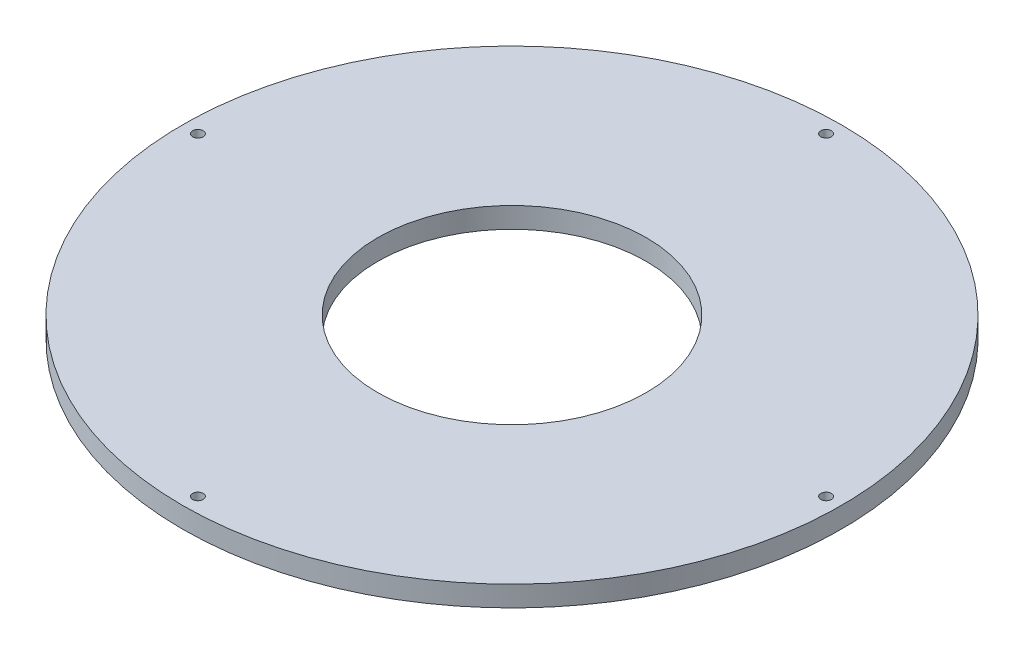
ISO-10303-21;
HEADER;
FILE_DESCRIPTION(('STEP AP214'),'2;1');
FILE_NAME('part.step','',(''),(''),'','','');
FILE_SCHEMA(('AUTOMOTIVE_DESIGN { 1 0 10303 214 1 1 1 1 }'));
ENDSEC;
DATA;
#1=APPLICATION_CONTEXT('core data for automotive mechanical design processes');
#2=APPLICATION_PROTOCOL_DEFINITION('international standard','automotive_design',2000,#1);
#3=PRODUCT_CONTEXT('',#1,'mechanical');
#4=PRODUCT('Part','Part','',(#3));
#5=PRODUCT_RELATED_PRODUCT_CATEGORY('part','',(#4));
#6=PRODUCT_DEFINITION_FORMATION('','',#4);
#7=PRODUCT_DEFINITION_CONTEXT('part definition',#1,'design');
#8=PRODUCT_DEFINITION('design','',#6,#7);
#9=PRODUCT_DEFINITION_SHAPE('','',#8);
#10=(LENGTH_UNIT() NAMED_UNIT(*) SI_UNIT(.MILLI.,.METRE.));
#11=(NAMED_UNIT(*) PLANE_ANGLE_UNIT() SI_UNIT($,.RADIAN.));
#12=(NAMED_UNIT(*) SI_UNIT($,.STERADIAN.) SOLID_ANGLE_UNIT());
#13=UNCERTAINTY_MEASURE_WITH_UNIT(LENGTH_MEASURE(1.E-05),#10,'distance_accuracy_value','');
#14=(GEOMETRIC_REPRESENTATION_CONTEXT(3) GLOBAL_UNCERTAINTY_ASSIGNED_CONTEXT((#13)) GLOBAL_UNIT_ASSIGNED_CONTEXT((#10,
#11,#12)) REPRESENTATION_CONTEXT('',''));
#15=CARTESIAN_POINT('',(0.,0.,0.));
#16=DIRECTION('',(0.,0.,1.));
#17=DIRECTION('',(1.,0.,0.));
#18=AXIS2_PLACEMENT_3D('',#15,#16,#17);
#19=CARTESIAN_POINT('',(0.,6.35,0.));
#20=DIRECTION('',(0.,1.,0.));
#21=DIRECTION('',(0.,0.,1.));
#22=AXIS2_PLACEMENT_3D('',#19,#20,#21);
#23=PLANE('',#22);
#24=CARTESIAN_POINT('',(0.,6.35,-96.8375));
#25=DIRECTION('',(0.,1.,0.));
#26=DIRECTION('',(0.,0.,1.));
#27=AXIS2_PLACEMENT_3D('',#24,#25,#26);
#28=CIRCLE('',#27,1.63194999999999);
#29=CARTESIAN_POINT('',(0.,6.35,-95.20555));
#30=VERTEX_POINT('',#29);
#31=EDGE_CURVE('E69',#30,#30,#28,.T.);
#32=ORIENTED_EDGE('',*,*,#31,.F.);
#33=EDGE_LOOP('',(#32));
#34=FACE_BOUND('',#33,.T.);
#35=CARTESIAN_POINT('',(96.8375,6.35,0.));
#36=DIRECTION('',(0.,1.,0.));
#37=DIRECTION('',(0.,0.,1.));
#38=AXIS2_PLACEMENT_3D('',#35,#36,#37);
#39=CIRCLE('',#38,1.63194999999999);
#40=CARTESIAN_POINT('',(96.8375,6.35,1.63194999999999));
#41=VERTEX_POINT('',#40);
#42=EDGE_CURVE('E63',#41,#41,#39,.T.);
#43=ORIENTED_EDGE('',*,*,#42,.F.);
#44=EDGE_LOOP('',(#43));
#45=FACE_BOUND('',#44,.T.);
#46=CARTESIAN_POINT('',(0.,6.35,96.8375));
#47=DIRECTION('',(0.,1.,0.));
#48=DIRECTION('',(0.,0.,1.));
#49=AXIS2_PLACEMENT_3D('',#46,#47,#48);
#50=CIRCLE('',#49,1.63194999999999);
#51=CARTESIAN_POINT('',(0.,6.35,98.46945));
#52=VERTEX_POINT('',#51);
#53=EDGE_CURVE('E57',#52,#52,#50,.T.);
#54=ORIENTED_EDGE('',*,*,#53,.F.);
#55=EDGE_LOOP('',(#54));
#56=FACE_BOUND('',#55,.T.);
#57=CARTESIAN_POINT('',(-96.8375,6.35,0.));
#58=DIRECTION('',(0.,1.,0.));
#59=DIRECTION('',(0.,0.,1.));
#60=AXIS2_PLACEMENT_3D('',#57,#58,#59);
#61=CIRCLE('',#60,1.63194999999999);
#62=CARTESIAN_POINT('',(-96.8375,6.35,1.63194999999999));
#63=VERTEX_POINT('',#62);
#64=EDGE_CURVE('E51',#63,#63,#61,.T.);
#65=ORIENTED_EDGE('',*,*,#64,.F.);
#66=EDGE_LOOP('',(#65));
#67=FACE_BOUND('',#66,.T.);
#68=CARTESIAN_POINT('',(0.,6.35,0.));
#69=DIRECTION('',(0.,1.,0.));
#70=DIRECTION('',(0.,0.,1.));
#71=AXIS2_PLACEMENT_3D('',#68,#69,#70);
#72=CIRCLE('',#71,101.6);
#73=CARTESIAN_POINT('',(0.,6.35,101.6));
#74=VERTEX_POINT('',#73);
#75=EDGE_CURVE('E10',#74,#74,#72,.T.);
#76=ORIENTED_EDGE('',*,*,#75,.T.);
#77=EDGE_LOOP('',(#76));
#78=FACE_BOUND('',#77,.T.);
#79=CARTESIAN_POINT('',(0.,6.35,0.));
#80=DIRECTION('',(0.,1.,0.));
#81=DIRECTION('',(0.,0.,1.));
#82=AXIS2_PLACEMENT_3D('',#79,#80,#81);
#83=CIRCLE('',#82,41.402);
#84=CARTESIAN_POINT('',(0.,6.35,41.402));
#85=VERTEX_POINT('',#84);
#86=EDGE_CURVE('E41',#85,#85,#83,.T.);
#87=ORIENTED_EDGE('',*,*,#86,.F.);
#88=EDGE_LOOP('',(#87));
#89=FACE_BOUND('',#88,.T.);
#90=ADVANCED_FACE('F30',(#34,#45,#56,#67,#78,#89),#23,.T.);
#91=CARTESIAN_POINT('',(0.,0.,0.));
#92=DIRECTION('',(0.,1.,0.));
#93=DIRECTION('',(0.,0.,1.));
#94=AXIS2_PLACEMENT_3D('',#91,#92,#93);
#95=PLANE('',#94);
#96=CARTESIAN_POINT('',(0.,0.,-96.8375));
#97=DIRECTION('',(0.,1.,0.));
#98=DIRECTION('',(0.,0.,1.));
#99=AXIS2_PLACEMENT_3D('',#96,#97,#98);
#100=CIRCLE('',#99,1.63195);
#101=CARTESIAN_POINT('',(0.,0.,-95.20555));
#102=VERTEX_POINT('',#101);
#103=EDGE_CURVE('E66',#102,#102,#100,.T.);
#104=ORIENTED_EDGE('',*,*,#103,.T.);
#105=EDGE_LOOP('',(#104));
#106=FACE_BOUND('',#105,.T.);
#107=CARTESIAN_POINT('',(96.8375,0.,0.));
#108=DIRECTION('',(0.,1.,0.));
#109=DIRECTION('',(0.,0.,1.));
#110=AXIS2_PLACEMENT_3D('',#107,#108,#109);
#111=CIRCLE('',#110,1.63194999999999);
#112=CARTESIAN_POINT('',(96.8375,0.,1.63194999999999));
#113=VERTEX_POINT('',#112);
#114=EDGE_CURVE('E60',#113,#113,#111,.T.);
#115=ORIENTED_EDGE('',*,*,#114,.T.);
#116=EDGE_LOOP('',(#115));
#117=FACE_BOUND('',#116,.T.);
#118=CARTESIAN_POINT('',(0.,0.,96.8375));
#119=DIRECTION('',(0.,1.,0.));
#120=DIRECTION('',(0.,0.,1.));
#121=AXIS2_PLACEMENT_3D('',#118,#119,#120);
#122=CIRCLE('',#121,1.63195);
#123=CARTESIAN_POINT('',(0.,0.,98.46945));
#124=VERTEX_POINT('',#123);
#125=EDGE_CURVE('E54',#124,#124,#122,.T.);
#126=ORIENTED_EDGE('',*,*,#125,.T.);
#127=EDGE_LOOP('',(#126));
#128=FACE_BOUND('',#127,.T.);
#129=CARTESIAN_POINT('',(-96.8375,0.,0.));
#130=DIRECTION('',(0.,1.,0.));
#131=DIRECTION('',(0.,0.,1.));
#132=AXIS2_PLACEMENT_3D('',#129,#130,#131);
#133=CIRCLE('',#132,1.63194999999999);
#134=CARTESIAN_POINT('',(-96.8375,0.,1.63194999999999));
#135=VERTEX_POINT('',#134);
#136=EDGE_CURVE('E46',#135,#135,#133,.T.);
#137=ORIENTED_EDGE('',*,*,#136,.T.);
#138=EDGE_LOOP('',(#137));
#139=FACE_BOUND('',#138,.T.);
#140=CARTESIAN_POINT('',(0.,0.,0.));
#141=DIRECTION('',(0.,1.,0.));
#142=DIRECTION('',(0.,0.,1.));
#143=AXIS2_PLACEMENT_3D('',#140,#141,#142);
#144=CIRCLE('',#143,101.6);
#145=CARTESIAN_POINT('',(0.,0.,101.6));
#146=VERTEX_POINT('',#145);
#147=EDGE_CURVE('E34',#146,#146,#144,.T.);
#148=ORIENTED_EDGE('',*,*,#147,.F.);
#149=EDGE_LOOP('',(#148));
#150=FACE_BOUND('',#149,.T.);
#151=CARTESIAN_POINT('',(0.,0.,0.));
#152=DIRECTION('',(0.,1.,0.));
#153=DIRECTION('',(0.,0.,1.));
#154=AXIS2_PLACEMENT_3D('',#151,#152,#153);
#155=CIRCLE('',#154,41.402);
#156=CARTESIAN_POINT('',(0.,0.,41.402));
#157=VERTEX_POINT('',#156);
#158=EDGE_CURVE('E43',#157,#157,#155,.T.);
#159=ORIENTED_EDGE('',*,*,#158,.T.);
#160=EDGE_LOOP('',(#159));
#161=FACE_BOUND('',#160,.T.);
#162=ADVANCED_FACE('F77',(#106,#117,#128,#139,#150,#161),#95,.F.);
#163=CARTESIAN_POINT('',(0.,6.35,0.));
#164=DIRECTION('',(0.,-1.,0.));
#165=DIRECTION('',(0.,0.,-1.));
#166=AXIS2_PLACEMENT_3D('',#163,#164,#165);
#167=CYLINDRICAL_SURFACE('',#166,101.6);
#168=ORIENTED_EDGE('',*,*,#75,.F.);
#169=EDGE_LOOP('',(#168));
#170=FACE_BOUND('',#169,.T.);
#171=ORIENTED_EDGE('',*,*,#147,.T.);
#172=EDGE_LOOP('',(#171));
#173=FACE_BOUND('',#172,.T.);
#174=ADVANCED_FACE('F32',(#170,#173),#167,.T.);
#175=CARTESIAN_POINT('',(0.,6.35,0.));
#176=DIRECTION('',(0.,-1.,0.));
#177=DIRECTION('',(0.,0.,-1.));
#178=AXIS2_PLACEMENT_3D('',#175,#176,#177);
#179=CYLINDRICAL_SURFACE('',#178,41.402);
#180=ORIENTED_EDGE('',*,*,#86,.T.);
#181=EDGE_LOOP('',(#180));
#182=FACE_BOUND('',#181,.T.);
#183=ORIENTED_EDGE('',*,*,#158,.F.);
#184=EDGE_LOOP('',(#183));
#185=FACE_BOUND('',#184,.T.);
#186=ADVANCED_FACE('F87',(#182,#185),#179,.F.);
#187=CARTESIAN_POINT('',(-96.8375,6.35,0.));
#188=DIRECTION('',(0.,1.,0.));
#189=DIRECTION('',(0.,0.,1.));
#190=AXIS2_PLACEMENT_3D('',#187,#188,#189);
#191=CYLINDRICAL_SURFACE('',#190,1.63194999999999);
#192=ORIENTED_EDGE('',*,*,#136,.F.);
#193=EDGE_LOOP('',(#192));
#194=FACE_BOUND('',#193,.T.);
#195=ORIENTED_EDGE('',*,*,#64,.T.);
#196=EDGE_LOOP('',(#195));
#197=FACE_BOUND('',#196,.T.);
#198=ADVANCED_FACE('F90',(#194,#197),#191,.F.);
#199=CARTESIAN_POINT('',(0.,6.35,96.8375));
#200=DIRECTION('',(0.,1.,0.));
#201=DIRECTION('',(0.,0.,1.));
#202=AXIS2_PLACEMENT_3D('',#199,#200,#201);
#203=CYLINDRICAL_SURFACE('',#202,1.63194999999999);
#204=ORIENTED_EDGE('',*,*,#125,.F.);
#205=EDGE_LOOP('',(#204));
#206=FACE_BOUND('',#205,.T.);
#207=ORIENTED_EDGE('',*,*,#53,.T.);
#208=EDGE_LOOP('',(#207));
#209=FACE_BOUND('',#208,.T.);
#210=ADVANCED_FACE('F104',(#206,#209),#203,.F.);
#211=CARTESIAN_POINT('',(96.8375,6.35,0.));
#212=DIRECTION('',(0.,1.,0.));
#213=DIRECTION('',(0.,0.,1.));
#214=AXIS2_PLACEMENT_3D('',#211,#212,#213);
#215=CYLINDRICAL_SURFACE('',#214,1.63194999999999);
#216=ORIENTED_EDGE('',*,*,#114,.F.);
#217=EDGE_LOOP('',(#216));
#218=FACE_BOUND('',#217,.T.);
#219=ORIENTED_EDGE('',*,*,#42,.T.);
#220=EDGE_LOOP('',(#219));
#221=FACE_BOUND('',#220,.T.);
#222=ADVANCED_FACE('F108',(#218,#221),#215,.F.);
#223=CARTESIAN_POINT('',(0.,6.35,-96.8375));
#224=DIRECTION('',(0.,1.,0.));
#225=DIRECTION('',(0.,0.,1.));
#226=AXIS2_PLACEMENT_3D('',#223,#224,#225);
#227=CYLINDRICAL_SURFACE('',#226,1.63194999999999);
#228=ORIENTED_EDGE('',*,*,#103,.F.);
#229=EDGE_LOOP('',(#228));
#230=FACE_BOUND('',#229,.T.);
#231=ORIENTED_EDGE('',*,*,#31,.T.);
#232=EDGE_LOOP('',(#231));
#233=FACE_BOUND('',#232,.T.);
#234=ADVANCED_FACE('F73',(#230,#233),#227,.F.);
#235=CLOSED_SHELL('',(#90,#162,#174,#186,#198,#210,#222,#234));
#236=MANIFOLD_SOLID_BREP('B2',#235);
#237=ADVANCED_BREP_SHAPE_REPRESENTATION('',(#18,#236),#14);
#238=SHAPE_DEFINITION_REPRESENTATION(#9,#237);
ENDSEC;
END-ISO-10303-21;
